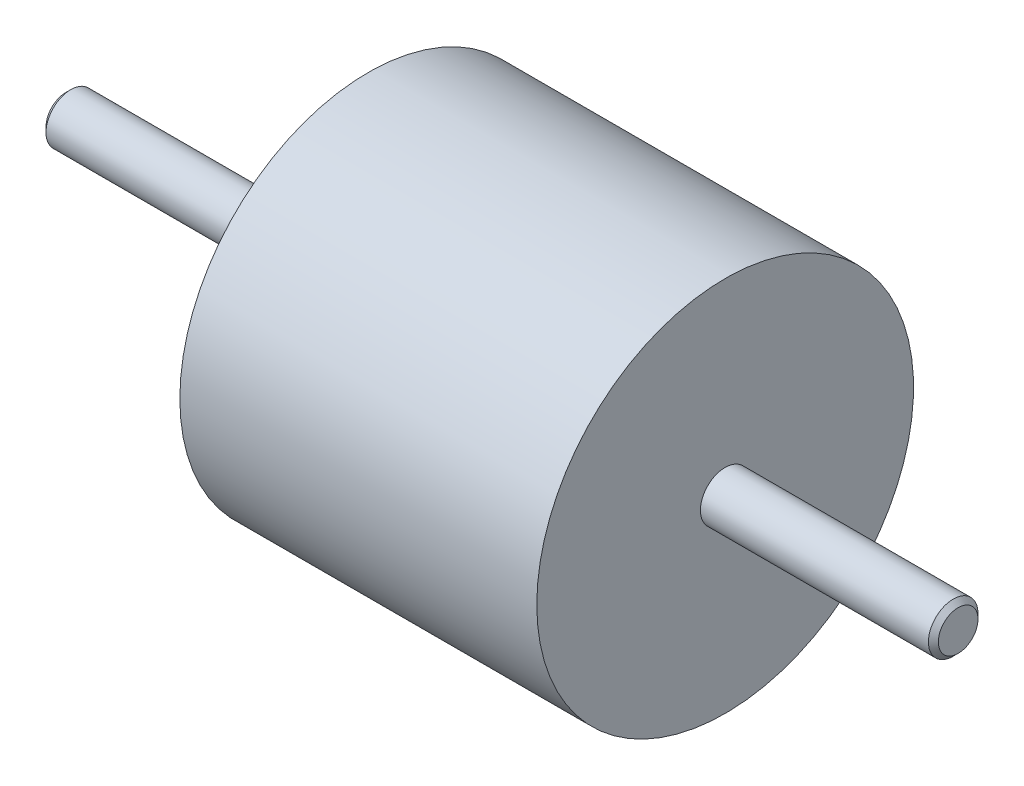
ISO-10303-21;
HEADER;
FILE_DESCRIPTION(('STEP AP214'),'2;1');
FILE_NAME('part.step','',(''),(''),'','','');
FILE_SCHEMA(('AUTOMOTIVE_DESIGN { 1 0 10303 214 1 1 1 1 }'));
ENDSEC;
DATA;
#1=APPLICATION_CONTEXT('core data for automotive mechanical design processes');
#2=APPLICATION_PROTOCOL_DEFINITION('international standard','automotive_design',2000,#1);
#3=PRODUCT_CONTEXT('',#1,'mechanical');
#4=PRODUCT('Part','Part','',(#3));
#5=PRODUCT_RELATED_PRODUCT_CATEGORY('part','',(#4));
#6=PRODUCT_DEFINITION_FORMATION('','',#4);
#7=PRODUCT_DEFINITION_CONTEXT('part definition',#1,'design');
#8=PRODUCT_DEFINITION('design','',#6,#7);
#9=PRODUCT_DEFINITION_SHAPE('','',#8);
#10=(LENGTH_UNIT() NAMED_UNIT(*) SI_UNIT(.MILLI.,.METRE.));
#11=(NAMED_UNIT(*) PLANE_ANGLE_UNIT() SI_UNIT($,.RADIAN.));
#12=(NAMED_UNIT(*) SI_UNIT($,.STERADIAN.) SOLID_ANGLE_UNIT());
#13=UNCERTAINTY_MEASURE_WITH_UNIT(LENGTH_MEASURE(1.E-05),#10,'distance_accuracy_value','');
#14=(GEOMETRIC_REPRESENTATION_CONTEXT(3) GLOBAL_UNCERTAINTY_ASSIGNED_CONTEXT((#13)) GLOBAL_UNIT_ASSIGNED_CONTEXT((#10,
#11,#12)) REPRESENTATION_CONTEXT('',''));
#15=CARTESIAN_POINT('',(0.,0.,0.));
#16=DIRECTION('',(0.,0.,1.));
#17=DIRECTION('',(1.,0.,0.));
#18=AXIS2_PLACEMENT_3D('',#15,#16,#17);
#19=CARTESIAN_POINT('',(-33.336541,-19.392259,0.));
#20=DIRECTION('',(1.,0.,0.));
#21=DIRECTION('',(0.,0.,-1.));
#22=AXIS2_PLACEMENT_3D('',#19,#20,#21);
#23=PLANE('',#22);
#24=CARTESIAN_POINT('',(-33.336541,-38.392259,0.));
#25=DIRECTION('',(-1.,0.,0.));
#26=DIRECTION('',(0.,0.,1.));
#27=AXIS2_PLACEMENT_3D('',#24,#25,#26);
#28=CIRCLE('',#27,2.5);
#29=CARTESIAN_POINT('',(-33.336541,-38.392259,2.5));
#30=VERTEX_POINT('',#29);
#31=EDGE_CURVE('E59',#30,#30,#28,.T.);
#32=ORIENTED_EDGE('',*,*,#31,.F.);
#33=EDGE_LOOP('',(#32));
#34=FACE_BOUND('',#33,.T.);
#35=CARTESIAN_POINT('',(-33.336541,-38.392259,0.));
#36=DIRECTION('',(-1.,0.,0.));
#37=DIRECTION('',(0.,0.,1.));
#38=AXIS2_PLACEMENT_3D('',#35,#36,#37);
#39=CIRCLE('',#38,19.);
#40=CARTESIAN_POINT('',(-33.336541,-38.392259,19.));
#41=VERTEX_POINT('',#40);
#42=EDGE_CURVE('E50',#41,#41,#39,.T.);
#43=ORIENTED_EDGE('',*,*,#42,.T.);
#44=EDGE_LOOP('',(#43));
#45=FACE_BOUND('',#44,.T.);
#46=ADVANCED_FACE('F31',(#34,#45),#23,.F.);
#47=CARTESIAN_POINT('',(-107.151340206186,-38.392259,0.));
#48=DIRECTION('',(-1.,0.,0.));
#49=DIRECTION('',(0.,0.,1.));
#50=AXIS2_PLACEMENT_3D('',#47,#48,#49);
#51=CYLINDRICAL_SURFACE('',#50,19.);
#52=ORIENTED_EDGE('',*,*,#42,.F.);
#53=EDGE_LOOP('',(#52));
#54=FACE_BOUND('',#53,.T.);
#55=CARTESIAN_POINT('',(2.66345900000001,-38.392259,0.));
#56=DIRECTION('',(-1.,0.,0.));
#57=DIRECTION('',(0.,0.,1.));
#58=AXIS2_PLACEMENT_3D('',#55,#56,#57);
#59=CIRCLE('',#58,19.);
#60=CARTESIAN_POINT('',(2.66345900000001,-38.392259,19.));
#61=VERTEX_POINT('',#60);
#62=EDGE_CURVE('E53',#61,#61,#59,.T.);
#63=ORIENTED_EDGE('',*,*,#62,.T.);
#64=EDGE_LOOP('',(#63));
#65=FACE_BOUND('',#64,.T.);
#66=ADVANCED_FACE('F67',(#54,#65),#51,.T.);
#67=CARTESIAN_POINT('',(2.663459,-35.892259,0.));
#68=DIRECTION('',(-1.,0.,0.));
#69=DIRECTION('',(0.,0.,1.));
#70=AXIS2_PLACEMENT_3D('',#67,#68,#69);
#71=PLANE('',#70);
#72=ORIENTED_EDGE('',*,*,#62,.F.);
#73=EDGE_LOOP('',(#72));
#74=FACE_BOUND('',#73,.T.);
#75=CARTESIAN_POINT('',(2.66345900000001,-38.392259,0.));
#76=DIRECTION('',(-1.,0.,0.));
#77=DIRECTION('',(0.,0.,1.));
#78=AXIS2_PLACEMENT_3D('',#75,#76,#77);
#79=CIRCLE('',#78,2.50000000000001);
#80=CARTESIAN_POINT('',(2.66345900000001,-38.392259,2.50000000000001));
#81=VERTEX_POINT('',#80);
#82=EDGE_CURVE('E56',#81,#81,#79,.T.);
#83=ORIENTED_EDGE('',*,*,#82,.T.);
#84=EDGE_LOOP('',(#83));
#85=FACE_BOUND('',#84,.T.);
#86=ADVANCED_FACE('F72',(#74,#85),#71,.F.);
#87=CARTESIAN_POINT('',(-107.151340206186,-38.392259,0.));
#88=DIRECTION('',(-1.,0.,0.));
#89=DIRECTION('',(0.,0.,1.));
#90=AXIS2_PLACEMENT_3D('',#87,#88,#89);
#91=CYLINDRICAL_SURFACE('',#90,2.50000000000001);
#92=CARTESIAN_POINT('',(25.663459,-38.392259,0.));
#93=DIRECTION('',(-1.,0.,0.));
#94=DIRECTION('',(0.,0.,1.));
#95=AXIS2_PLACEMENT_3D('',#92,#93,#94);
#96=CIRCLE('',#95,2.50000000000001);
#97=CARTESIAN_POINT('',(25.663459,-38.392259,2.50000000000001));
#98=VERTEX_POINT('',#97);
#99=EDGE_CURVE('E37',#98,#98,#96,.T.);
#100=ORIENTED_EDGE('',*,*,#99,.T.);
#101=EDGE_LOOP('',(#100));
#102=FACE_BOUND('',#101,.T.);
#103=ORIENTED_EDGE('',*,*,#82,.F.);
#104=EDGE_LOOP('',(#103));
#105=FACE_BOUND('',#104,.T.);
#106=ADVANCED_FACE('F77',(#102,#105),#91,.T.);
#107=CARTESIAN_POINT('',(26.163459,-35.892259,0.));
#108=DIRECTION('',(-1.,0.,0.));
#109=DIRECTION('',(0.,0.,1.));
#110=AXIS2_PLACEMENT_3D('',#107,#108,#109);
#111=PLANE('',#110);
#112=CARTESIAN_POINT('',(26.163459,-38.392259,0.));
#113=DIRECTION('',(-1.,0.,0.));
#114=DIRECTION('',(0.,0.,1.));
#115=AXIS2_PLACEMENT_3D('',#112,#113,#114);
#116=CIRCLE('',#115,2.00000000000003);
#117=CARTESIAN_POINT('',(26.163459,-38.392259,2.00000000000003));
#118=VERTEX_POINT('',#117);
#119=EDGE_CURVE('E10',#118,#118,#116,.F.);
#120=ORIENTED_EDGE('',*,*,#119,.T.);
#121=EDGE_LOOP('',(#120));
#122=FACE_BOUND('',#121,.T.);
#123=ADVANCED_FACE('F82',(#122),#111,.F.);
#124=CARTESIAN_POINT('',(-63.836541,-38.392259,0.));
#125=DIRECTION('',(1.,0.,0.));
#126=DIRECTION('',(0.,0.,-1.));
#127=AXIS2_PLACEMENT_3D('',#124,#125,#126);
#128=PLANE('',#127);
#129=CARTESIAN_POINT('',(-63.836541,-38.392259,0.));
#130=DIRECTION('',(1.,0.,0.));
#131=DIRECTION('',(0.,0.,-1.));
#132=AXIS2_PLACEMENT_3D('',#129,#130,#131);
#133=CIRCLE('',#132,1.99999999999999);
#134=CARTESIAN_POINT('',(-63.836541,-38.392259,-1.99999999999999));
#135=VERTEX_POINT('',#134);
#136=EDGE_CURVE('E45',#135,#135,#133,.F.);
#137=ORIENTED_EDGE('',*,*,#136,.T.);
#138=EDGE_LOOP('',(#137));
#139=FACE_BOUND('',#138,.T.);
#140=ADVANCED_FACE('F87',(#139),#128,.F.);
#141=CARTESIAN_POINT('',(-107.151340206186,-38.392259,0.));
#142=DIRECTION('',(-1.,0.,0.));
#143=DIRECTION('',(0.,0.,1.));
#144=AXIS2_PLACEMENT_3D('',#141,#142,#143);
#145=CYLINDRICAL_SURFACE('',#144,2.5);
#146=CARTESIAN_POINT('',(-63.336541,-38.392259,0.));
#147=DIRECTION('',(1.,0.,0.));
#148=DIRECTION('',(0.,0.,-1.));
#149=AXIS2_PLACEMENT_3D('',#146,#147,#148);
#150=CIRCLE('',#149,2.5);
#151=CARTESIAN_POINT('',(-63.336541,-38.392259,-2.5));
#152=VERTEX_POINT('',#151);
#153=EDGE_CURVE('E41',#152,#152,#150,.T.);
#154=ORIENTED_EDGE('',*,*,#153,.T.);
#155=EDGE_LOOP('',(#154));
#156=FACE_BOUND('',#155,.T.);
#157=ORIENTED_EDGE('',*,*,#31,.T.);
#158=EDGE_LOOP('',(#157));
#159=FACE_BOUND('',#158,.T.);
#160=ADVANCED_FACE('F63',(#156,#159),#145,.T.);
#161=CARTESIAN_POINT('',(-63.836541,-38.392259,0.));
#162=DIRECTION('',(1.,0.,0.));
#163=DIRECTION('',(0.,0.,-1.));
#164=AXIS2_PLACEMENT_3D('',#161,#162,#163);
#165=CONICAL_SURFACE('',#164,1.99999999999999,0.785398163397451);
#166=ORIENTED_EDGE('',*,*,#153,.F.);
#167=EDGE_LOOP('',(#166));
#168=FACE_BOUND('',#167,.T.);
#169=ORIENTED_EDGE('',*,*,#136,.F.);
#170=EDGE_LOOP('',(#169));
#171=FACE_BOUND('',#170,.T.);
#172=ADVANCED_FACE('F95',(#168,#171),#165,.T.);
#173=CARTESIAN_POINT('',(25.663459,-38.392259,0.));
#174=DIRECTION('',(-1.,0.,0.));
#175=DIRECTION('',(0.,0.,1.));
#176=AXIS2_PLACEMENT_3D('',#173,#174,#175);
#177=CONICAL_SURFACE('',#176,2.50000000000001,0.785398163397439);
#178=ORIENTED_EDGE('',*,*,#119,.F.);
#179=EDGE_LOOP('',(#178));
#180=FACE_BOUND('',#179,.T.);
#181=ORIENTED_EDGE('',*,*,#99,.F.);
#182=EDGE_LOOP('',(#181));
#183=FACE_BOUND('',#182,.T.);
#184=ADVANCED_FACE('F99',(#180,#183),#177,.T.);
#185=CLOSED_SHELL('',(#46,#66,#86,#106,#123,#140,#160,#172,#184));
#186=MANIFOLD_SOLID_BREP('B2',#185);
#187=ADVANCED_BREP_SHAPE_REPRESENTATION('',(#18,#186),#14);
#188=SHAPE_DEFINITION_REPRESENTATION(#9,#187);
ENDSEC;
END-ISO-10303-21;
